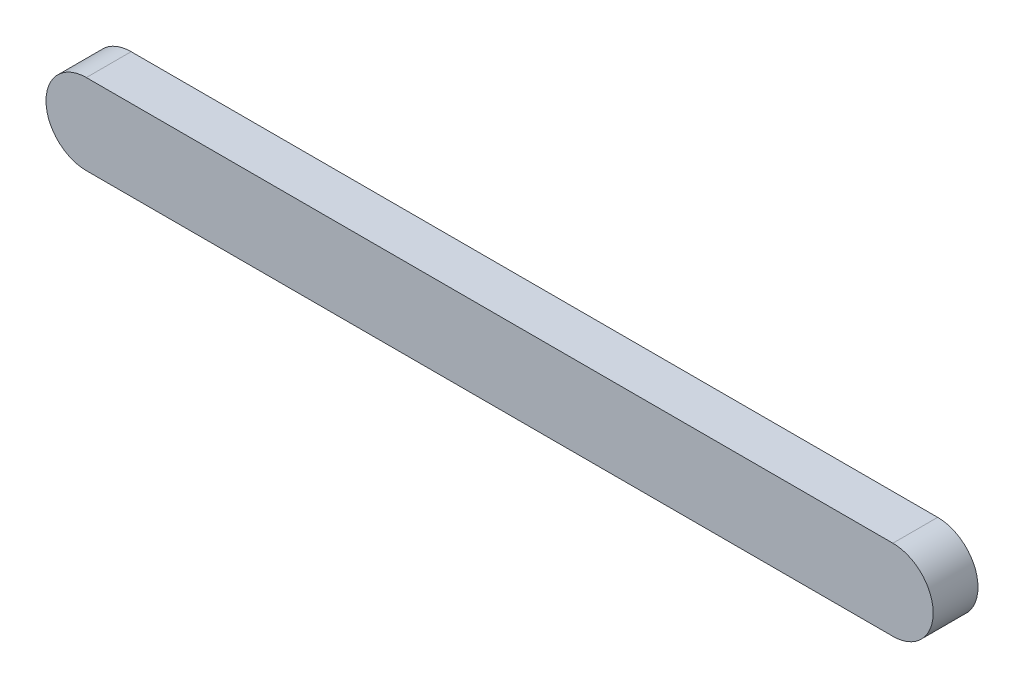
ISO-10303-21;
HEADER;
FILE_DESCRIPTION(('STEP AP214'),'2;1');
FILE_NAME('part.step','',(''),(''),'','','');
FILE_SCHEMA(('AUTOMOTIVE_DESIGN { 1 0 10303 214 1 1 1 1 }'));
ENDSEC;
DATA;
#1=APPLICATION_CONTEXT('core data for automotive mechanical design processes');
#2=APPLICATION_PROTOCOL_DEFINITION('international standard','automotive_design',2000,#1);
#3=PRODUCT_CONTEXT('',#1,'mechanical');
#4=PRODUCT('Part','Part','',(#3));
#5=PRODUCT_RELATED_PRODUCT_CATEGORY('part','',(#4));
#6=PRODUCT_DEFINITION_FORMATION('','',#4);
#7=PRODUCT_DEFINITION_CONTEXT('part definition',#1,'design');
#8=PRODUCT_DEFINITION('design','',#6,#7);
#9=PRODUCT_DEFINITION_SHAPE('','',#8);
#10=(LENGTH_UNIT() NAMED_UNIT(*) SI_UNIT(.MILLI.,.METRE.));
#11=(NAMED_UNIT(*) PLANE_ANGLE_UNIT() SI_UNIT($,.RADIAN.));
#12=(NAMED_UNIT(*) SI_UNIT($,.STERADIAN.) SOLID_ANGLE_UNIT());
#13=UNCERTAINTY_MEASURE_WITH_UNIT(LENGTH_MEASURE(1.E-05),#10,'distance_accuracy_value','');
#14=(GEOMETRIC_REPRESENTATION_CONTEXT(3) GLOBAL_UNCERTAINTY_ASSIGNED_CONTEXT((#13)) GLOBAL_UNIT_ASSIGNED_CONTEXT((#10,
#11,#12)) REPRESENTATION_CONTEXT('',''));
#15=CARTESIAN_POINT('',(0.,0.,0.));
#16=DIRECTION('',(0.,0.,1.));
#17=DIRECTION('',(1.,0.,0.));
#18=AXIS2_PLACEMENT_3D('',#15,#16,#17);
#19=CARTESIAN_POINT('',(0.,-4.5,5.));
#20=DIRECTION('',(0.,1.,0.));
#21=DIRECTION('',(0.,0.,1.));
#22=AXIS2_PLACEMENT_3D('',#19,#20,#21);
#23=PLANE('',#22);
#24=DIRECTION('',(1.,0.,0.));
#25=VECTOR('',#24,1.);
#26=CARTESIAN_POINT('',(0.,-4.5,0.));
#27=LINE('',#26,#25);
#28=CARTESIAN_POINT('',(0.,-4.5,0.));
#29=VERTEX_POINT('',#28);
#30=CARTESIAN_POINT('',(90.,-4.5,0.));
#31=VERTEX_POINT('',#30);
#32=EDGE_CURVE('E97',#29,#31,#27,.T.);
#33=ORIENTED_EDGE('',*,*,#32,.T.);
#34=DIRECTION('',(0.,0.,-1.));
#35=VECTOR('',#34,1.);
#36=CARTESIAN_POINT('',(90.,-4.5,5.));
#37=LINE('',#36,#35);
#38=CARTESIAN_POINT('',(90.,-4.5,5.));
#39=VERTEX_POINT('',#38);
#40=EDGE_CURVE('E11',#39,#31,#37,.T.);
#41=ORIENTED_EDGE('',*,*,#40,.F.);
#42=DIRECTION('',(1.,0.,0.));
#43=VECTOR('',#42,1.);
#44=CARTESIAN_POINT('',(0.,-4.5,5.));
#45=LINE('',#44,#43);
#46=CARTESIAN_POINT('',(0.,-4.5,5.));
#47=VERTEX_POINT('',#46);
#48=EDGE_CURVE('E82',#47,#39,#45,.T.);
#49=ORIENTED_EDGE('',*,*,#48,.F.);
#50=DIRECTION('',(0.,0.,-1.));
#51=VECTOR('',#50,1.);
#52=CARTESIAN_POINT('',(0.,-4.5,5.));
#53=LINE('',#52,#51);
#54=EDGE_CURVE('E93',#47,#29,#53,.T.);
#55=ORIENTED_EDGE('',*,*,#54,.T.);
#56=EDGE_LOOP('',(#33,#41,#49,#55));
#57=FACE_BOUND('',#56,.T.);
#58=ADVANCED_FACE('F35',(#57),#23,.F.);
#59=CARTESIAN_POINT('',(90.,0.,5.));
#60=DIRECTION('',(0.,0.,-1.));
#61=DIRECTION('',(-1.,0.,0.));
#62=AXIS2_PLACEMENT_3D('',#59,#60,#61);
#63=CYLINDRICAL_SURFACE('',#62,4.49999999999999);
#64=CARTESIAN_POINT('',(90.,0.,0.));
#65=DIRECTION('',(0.,0.,1.));
#66=DIRECTION('',(1.,0.,0.));
#67=AXIS2_PLACEMENT_3D('',#64,#65,#66);
#68=CIRCLE('',#67,4.49999999999999);
#69=CARTESIAN_POINT('',(90.,4.49999999999999,0.));
#70=VERTEX_POINT('',#69);
#71=EDGE_CURVE('E87',#31,#70,#68,.T.);
#72=ORIENTED_EDGE('',*,*,#71,.T.);
#73=DIRECTION('',(0.,0.,-1.));
#74=VECTOR('',#73,1.);
#75=CARTESIAN_POINT('',(90.,4.49999999999999,5.));
#76=LINE('',#75,#74);
#77=CARTESIAN_POINT('',(90.,4.49999999999999,5.));
#78=VERTEX_POINT('',#77);
#79=EDGE_CURVE('E43',#78,#70,#76,.T.);
#80=ORIENTED_EDGE('',*,*,#79,.F.);
#81=CARTESIAN_POINT('',(90.,0.,5.));
#82=DIRECTION('',(0.,0.,1.));
#83=DIRECTION('',(1.,0.,0.));
#84=AXIS2_PLACEMENT_3D('',#81,#82,#83);
#85=CIRCLE('',#84,4.49999999999999);
#86=EDGE_CURVE('E77',#39,#78,#85,.T.);
#87=ORIENTED_EDGE('',*,*,#86,.F.);
#88=ORIENTED_EDGE('',*,*,#40,.T.);
#89=EDGE_LOOP('',(#72,#80,#87,#88));
#90=FACE_BOUND('',#89,.T.);
#91=ADVANCED_FACE('F86',(#90),#63,.T.);
#92=CARTESIAN_POINT('',(0.,4.5,5.));
#93=DIRECTION('',(0.,1.,0.));
#94=DIRECTION('',(0.,0.,1.));
#95=AXIS2_PLACEMENT_3D('',#92,#93,#94);
#96=PLANE('',#95);
#97=DIRECTION('',(1.,0.,0.));
#98=VECTOR('',#97,1.);
#99=CARTESIAN_POINT('',(0.,4.5,0.));
#100=LINE('',#99,#98);
#101=CARTESIAN_POINT('',(0.,4.5,0.));
#102=VERTEX_POINT('',#101);
#103=EDGE_CURVE('E101',#102,#70,#100,.T.);
#104=ORIENTED_EDGE('',*,*,#103,.F.);
#105=DIRECTION('',(0.,0.,-1.));
#106=VECTOR('',#105,1.);
#107=CARTESIAN_POINT('',(0.,4.5,5.));
#108=LINE('',#107,#106);
#109=CARTESIAN_POINT('',(0.,4.5,5.));
#110=VERTEX_POINT('',#109);
#111=EDGE_CURVE('E67',#110,#102,#108,.T.);
#112=ORIENTED_EDGE('',*,*,#111,.F.);
#113=DIRECTION('',(1.,0.,0.));
#114=VECTOR('',#113,1.);
#115=CARTESIAN_POINT('',(0.,4.5,5.));
#116=LINE('',#115,#114);
#117=EDGE_CURVE('E80',#110,#78,#116,.T.);
#118=ORIENTED_EDGE('',*,*,#117,.T.);
#119=ORIENTED_EDGE('',*,*,#79,.T.);
#120=EDGE_LOOP('',(#104,#112,#118,#119));
#121=FACE_BOUND('',#120,.T.);
#122=ADVANCED_FACE('F91',(#121),#96,.T.);
#123=CARTESIAN_POINT('',(0.,0.,5.));
#124=DIRECTION('',(0.,0.,-1.));
#125=DIRECTION('',(-1.,0.,0.));
#126=AXIS2_PLACEMENT_3D('',#123,#124,#125);
#127=CYLINDRICAL_SURFACE('',#126,4.5);
#128=CARTESIAN_POINT('',(0.,0.,0.));
#129=DIRECTION('',(0.,0.,1.));
#130=DIRECTION('',(1.,0.,0.));
#131=AXIS2_PLACEMENT_3D('',#128,#129,#130);
#132=CIRCLE('',#131,4.5);
#133=EDGE_CURVE('E70',#102,#29,#132,.T.);
#134=ORIENTED_EDGE('',*,*,#133,.T.);
#135=ORIENTED_EDGE('',*,*,#54,.F.);
#136=CARTESIAN_POINT('',(0.,0.,5.));
#137=DIRECTION('',(0.,0.,1.));
#138=DIRECTION('',(1.,0.,0.));
#139=AXIS2_PLACEMENT_3D('',#136,#137,#138);
#140=CIRCLE('',#139,4.5);
#141=EDGE_CURVE('E51',#110,#47,#140,.T.);
#142=ORIENTED_EDGE('',*,*,#141,.F.);
#143=ORIENTED_EDGE('',*,*,#111,.T.);
#144=EDGE_LOOP('',(#134,#135,#142,#143));
#145=FACE_BOUND('',#144,.T.);
#146=ADVANCED_FACE('F114',(#145),#127,.T.);
#147=CARTESIAN_POINT('',(0.,0.,5.));
#148=DIRECTION('',(0.,0.,1.));
#149=DIRECTION('',(1.,0.,0.));
#150=AXIS2_PLACEMENT_3D('',#147,#148,#149);
#151=PLANE('',#150);
#152=ORIENTED_EDGE('',*,*,#48,.T.);
#153=ORIENTED_EDGE('',*,*,#86,.T.);
#154=ORIENTED_EDGE('',*,*,#117,.F.);
#155=ORIENTED_EDGE('',*,*,#141,.T.);
#156=EDGE_LOOP('',(#152,#153,#154,#155));
#157=FACE_BOUND('',#156,.T.);
#158=ADVANCED_FACE('F78',(#157),#151,.T.);
#159=CARTESIAN_POINT('',(0.,0.,0.));
#160=DIRECTION('',(0.,0.,1.));
#161=DIRECTION('',(1.,0.,0.));
#162=AXIS2_PLACEMENT_3D('',#159,#160,#161);
#163=PLANE('',#162);
#164=ORIENTED_EDGE('',*,*,#32,.F.);
#165=ORIENTED_EDGE('',*,*,#133,.F.);
#166=ORIENTED_EDGE('',*,*,#103,.T.);
#167=ORIENTED_EDGE('',*,*,#71,.F.);
#168=EDGE_LOOP('',(#164,#165,#166,#167));
#169=FACE_BOUND('',#168,.T.);
#170=ADVANCED_FACE('F108',(#169),#163,.F.);
#171=CLOSED_SHELL('',(#58,#91,#122,#146,#158,#170));
#172=MANIFOLD_SOLID_BREP('B2',#171);
#173=ADVANCED_BREP_SHAPE_REPRESENTATION('',(#18,#172),#14);
#174=SHAPE_DEFINITION_REPRESENTATION(#9,#173);
ENDSEC;
END-ISO-10303-21;
